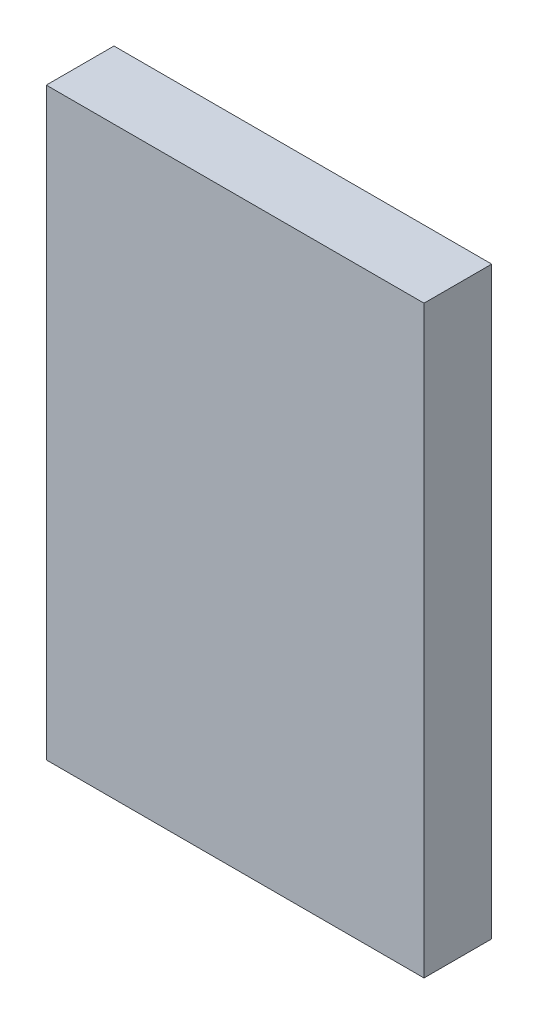
ISO-10303-21;
HEADER;
FILE_DESCRIPTION(('STEP AP214'),'2;1');
FILE_NAME('part.step','',(''),(''),'','','');
FILE_SCHEMA(('AUTOMOTIVE_DESIGN { 1 0 10303 214 1 1 1 1 }'));
ENDSEC;
DATA;
#1=APPLICATION_CONTEXT('core data for automotive mechanical design processes');
#2=APPLICATION_PROTOCOL_DEFINITION('international standard','automotive_design',2000,#1);
#3=PRODUCT_CONTEXT('',#1,'mechanical');
#4=PRODUCT('Part','Part','',(#3));
#5=PRODUCT_RELATED_PRODUCT_CATEGORY('part','',(#4));
#6=PRODUCT_DEFINITION_FORMATION('','',#4);
#7=PRODUCT_DEFINITION_CONTEXT('part definition',#1,'design');
#8=PRODUCT_DEFINITION('design','',#6,#7);
#9=PRODUCT_DEFINITION_SHAPE('','',#8);
#10=(LENGTH_UNIT() NAMED_UNIT(*) SI_UNIT(.MILLI.,.METRE.));
#11=(NAMED_UNIT(*) PLANE_ANGLE_UNIT() SI_UNIT($,.RADIAN.));
#12=(NAMED_UNIT(*) SI_UNIT($,.STERADIAN.) SOLID_ANGLE_UNIT());
#13=UNCERTAINTY_MEASURE_WITH_UNIT(LENGTH_MEASURE(1.E-05),#10,'distance_accuracy_value','');
#14=(GEOMETRIC_REPRESENTATION_CONTEXT(3) GLOBAL_UNCERTAINTY_ASSIGNED_CONTEXT((#13)) GLOBAL_UNIT_ASSIGNED_CONTEXT((#10,
#11,#12)) REPRESENTATION_CONTEXT('',''));
#15=CARTESIAN_POINT('',(0.,0.,0.));
#16=DIRECTION('',(0.,0.,1.));
#17=DIRECTION('',(1.,0.,0.));
#18=AXIS2_PLACEMENT_3D('',#15,#16,#17);
#19=CARTESIAN_POINT('',(0.,0.,9.5));
#20=DIRECTION('',(0.,1.,0.));
#21=DIRECTION('',(0.,0.,1.));
#22=AXIS2_PLACEMENT_3D('',#19,#20,#21);
#23=PLANE('',#22);
#24=DIRECTION('',(1.,0.,0.));
#25=VECTOR('',#24,1.);
#26=CARTESIAN_POINT('',(0.,0.,0.));
#27=LINE('',#26,#25);
#28=CARTESIAN_POINT('',(27.25,0.,0.));
#29=VERTEX_POINT('',#28);
#30=CARTESIAN_POINT('',(44.25,0.,0.));
#31=VERTEX_POINT('',#30);
#32=EDGE_CURVE('E471',#29,#31,#27,.T.);
#33=ORIENTED_EDGE('',*,*,#32,.T.);
#34=DIRECTION('',(0.,0.,-1.));
#35=VECTOR('',#34,1.);
#36=CARTESIAN_POINT('',(44.25,0.,5.5));
#37=LINE('',#36,#35);
#38=CARTESIAN_POINT('',(44.25,0.,5.5));
#39=VERTEX_POINT('',#38);
#40=EDGE_CURVE('E65',#39,#31,#37,.T.);
#41=ORIENTED_EDGE('',*,*,#40,.F.);
#42=DIRECTION('',(1.,0.,0.));
#43=VECTOR('',#42,1.);
#44=CARTESIAN_POINT('',(0.,0.,5.5));
#45=LINE('',#44,#43);
#46=CARTESIAN_POINT('',(45.75,0.,5.5));
#47=VERTEX_POINT('',#46);
#48=EDGE_CURVE('E60',#39,#47,#45,.T.);
#49=ORIENTED_EDGE('',*,*,#48,.T.);
#50=DIRECTION('',(0.,0.,-1.));
#51=VECTOR('',#50,1.);
#52=CARTESIAN_POINT('',(45.75,0.,5.5));
#53=LINE('',#52,#51);
#54=CARTESIAN_POINT('',(45.75,0.,0.));
#55=VERTEX_POINT('',#54);
#56=EDGE_CURVE('E246',#47,#55,#53,.T.);
#57=ORIENTED_EDGE('',*,*,#56,.T.);
#58=CARTESIAN_POINT('',(53.,0.,0.));
#59=VERTEX_POINT('',#58);
#60=EDGE_CURVE('E402',#55,#59,#27,.T.);
#61=ORIENTED_EDGE('',*,*,#60,.T.);
#62=DIRECTION('',(0.,0.,-1.));
#63=VECTOR('',#62,1.);
#64=CARTESIAN_POINT('',(53.,0.,9.5));
#65=LINE('',#64,#63);
#66=CARTESIAN_POINT('',(53.,0.,9.5));
#67=VERTEX_POINT('',#66);
#68=EDGE_CURVE('E11',#67,#59,#65,.T.);
#69=ORIENTED_EDGE('',*,*,#68,.F.);
#70=DIRECTION('',(1.,0.,0.));
#71=VECTOR('',#70,1.);
#72=CARTESIAN_POINT('',(0.,0.,9.5));
#73=LINE('',#72,#71);
#74=CARTESIAN_POINT('',(0.,0.,9.5));
#75=VERTEX_POINT('',#74);
#76=EDGE_CURVE('E403',#75,#67,#73,.T.);
#77=ORIENTED_EDGE('',*,*,#76,.F.);
#78=DIRECTION('',(0.,0.,-1.));
#79=VECTOR('',#78,1.);
#80=CARTESIAN_POINT('',(0.,0.,9.5));
#81=LINE('',#80,#79);
#82=CARTESIAN_POINT('',(0.,0.,0.));
#83=VERTEX_POINT('',#82);
#84=EDGE_CURVE('E419',#75,#83,#81,.T.);
#85=ORIENTED_EDGE('',*,*,#84,.T.);
#86=CARTESIAN_POINT('',(7.25,0.,0.));
#87=VERTEX_POINT('',#86);
#88=EDGE_CURVE('E420',#83,#87,#27,.T.);
#89=ORIENTED_EDGE('',*,*,#88,.T.);
#90=DIRECTION('',(0.,0.,-1.));
#91=VECTOR('',#90,1.);
#92=CARTESIAN_POINT('',(7.25,0.,5.5));
#93=LINE('',#92,#91);
#94=CARTESIAN_POINT('',(7.25,0.,5.5));
#95=VERTEX_POINT('',#94);
#96=EDGE_CURVE('E305',#95,#87,#93,.T.);
#97=ORIENTED_EDGE('',*,*,#96,.F.);
#98=DIRECTION('',(1.,0.,0.));
#99=VECTOR('',#98,1.);
#100=CARTESIAN_POINT('',(0.,0.,5.5));
#101=LINE('',#100,#99);
#102=CARTESIAN_POINT('',(8.75,0.,5.5));
#103=VERTEX_POINT('',#102);
#104=EDGE_CURVE('E301',#95,#103,#101,.T.);
#105=ORIENTED_EDGE('',*,*,#104,.T.);
#106=DIRECTION('',(0.,0.,-1.));
#107=VECTOR('',#106,1.);
#108=CARTESIAN_POINT('',(8.75,0.,5.5));
#109=LINE('',#108,#107);
#110=CARTESIAN_POINT('',(8.75,0.,0.));
#111=VERTEX_POINT('',#110);
#112=EDGE_CURVE('E316',#103,#111,#109,.T.);
#113=ORIENTED_EDGE('',*,*,#112,.T.);
#114=CARTESIAN_POINT('',(25.75,0.,0.));
#115=VERTEX_POINT('',#114);
#116=EDGE_CURVE('E425',#111,#115,#27,.T.);
#117=ORIENTED_EDGE('',*,*,#116,.T.);
#118=DIRECTION('',(0.,0.,-1.));
#119=VECTOR('',#118,1.);
#120=CARTESIAN_POINT('',(25.75,0.,5.5));
#121=LINE('',#120,#119);
#122=CARTESIAN_POINT('',(25.75,0.,5.5));
#123=VERTEX_POINT('',#122);
#124=EDGE_CURVE('E266',#123,#115,#121,.T.);
#125=ORIENTED_EDGE('',*,*,#124,.F.);
#126=DIRECTION('',(1.,0.,0.));
#127=VECTOR('',#126,1.);
#128=CARTESIAN_POINT('',(0.,0.,5.5));
#129=LINE('',#128,#127);
#130=CARTESIAN_POINT('',(27.25,0.,5.5));
#131=VERTEX_POINT('',#130);
#132=EDGE_CURVE('E263',#123,#131,#129,.T.);
#133=ORIENTED_EDGE('',*,*,#132,.T.);
#134=DIRECTION('',(0.,0.,-1.));
#135=VECTOR('',#134,1.);
#136=CARTESIAN_POINT('',(27.25,0.,5.5));
#137=LINE('',#136,#135);
#138=EDGE_CURVE('E279',#131,#29,#137,.T.);
#139=ORIENTED_EDGE('',*,*,#138,.T.);
#140=EDGE_LOOP('',(#33,#41,#49,#57,#61,#69,#77,#85,#89,#97,#105,#113,#117,#125,#133,#139));
#141=FACE_BOUND('',#140,.T.);
#142=ADVANCED_FACE('F45',(#141),#23,.F.);
#143=CARTESIAN_POINT('',(53.,0.,9.5));
#144=DIRECTION('',(-1.,0.,0.));
#145=DIRECTION('',(0.,0.,1.));
#146=AXIS2_PLACEMENT_3D('',#143,#144,#145);
#147=PLANE('',#146);
#148=DIRECTION('',(0.,1.,0.));
#149=VECTOR('',#148,1.);
#150=CARTESIAN_POINT('',(53.,0.,0.));
#151=LINE('',#150,#149);
#152=CARTESIAN_POINT('',(53.,82.,0.));
#153=VERTEX_POINT('',#152);
#154=EDGE_CURVE('E424',#59,#153,#151,.T.);
#155=ORIENTED_EDGE('',*,*,#154,.T.);
#156=DIRECTION('',(0.,0.,-1.));
#157=VECTOR('',#156,1.);
#158=CARTESIAN_POINT('',(53.,82.,9.5));
#159=LINE('',#158,#157);
#160=CARTESIAN_POINT('',(53.,82.,9.5));
#161=VERTEX_POINT('',#160);
#162=EDGE_CURVE('E53',#161,#153,#159,.T.);
#163=ORIENTED_EDGE('',*,*,#162,.F.);
#164=DIRECTION('',(0.,1.,0.));
#165=VECTOR('',#164,1.);
#166=CARTESIAN_POINT('',(53.,0.,9.5));
#167=LINE('',#166,#165);
#168=EDGE_CURVE('E407',#67,#161,#167,.T.);
#169=ORIENTED_EDGE('',*,*,#168,.F.);
#170=ORIENTED_EDGE('',*,*,#68,.T.);
#171=EDGE_LOOP('',(#155,#163,#169,#170));
#172=FACE_BOUND('',#171,.T.);
#173=ADVANCED_FACE('F451',(#172),#147,.F.);
#174=CARTESIAN_POINT('',(0.,82.,9.5));
#175=DIRECTION('',(0.,1.,0.));
#176=DIRECTION('',(0.,0.,1.));
#177=AXIS2_PLACEMENT_3D('',#174,#175,#176);
#178=PLANE('',#177);
#179=DIRECTION('',(1.,0.,0.));
#180=VECTOR('',#179,1.);
#181=CARTESIAN_POINT('',(0.,82.,0.));
#182=LINE('',#181,#180);
#183=CARTESIAN_POINT('',(0.,82.,0.));
#184=VERTEX_POINT('',#183);
#185=EDGE_CURVE('E429',#184,#153,#182,.T.);
#186=ORIENTED_EDGE('',*,*,#185,.F.);
#187=DIRECTION('',(0.,0.,-1.));
#188=VECTOR('',#187,1.);
#189=CARTESIAN_POINT('',(0.,82.,9.5));
#190=LINE('',#189,#188);
#191=CARTESIAN_POINT('',(0.,82.,9.5));
#192=VERTEX_POINT('',#191);
#193=EDGE_CURVE('E440',#192,#184,#190,.T.);
#194=ORIENTED_EDGE('',*,*,#193,.F.);
#195=DIRECTION('',(1.,0.,0.));
#196=VECTOR('',#195,1.);
#197=CARTESIAN_POINT('',(0.,82.,9.5));
#198=LINE('',#197,#196);
#199=EDGE_CURVE('E411',#192,#161,#198,.T.);
#200=ORIENTED_EDGE('',*,*,#199,.T.);
#201=ORIENTED_EDGE('',*,*,#162,.T.);
#202=EDGE_LOOP('',(#186,#194,#200,#201));
#203=FACE_BOUND('',#202,.T.);
#204=ADVANCED_FACE('F447',(#203),#178,.T.);
#205=CARTESIAN_POINT('',(0.,0.,9.5));
#206=DIRECTION('',(-1.,0.,0.));
#207=DIRECTION('',(0.,0.,1.));
#208=AXIS2_PLACEMENT_3D('',#205,#206,#207);
#209=PLANE('',#208);
#210=DIRECTION('',(0.,0.,-1.));
#211=VECTOR('',#210,1.);
#212=CARTESIAN_POINT('',(0.,14.75,5.5));
#213=LINE('',#212,#211);
#214=CARTESIAN_POINT('',(0.,14.75,5.5));
#215=VERTEX_POINT('',#214);
#216=CARTESIAN_POINT('',(0.,14.75,0.));
#217=VERTEX_POINT('',#216);
#218=EDGE_CURVE('E342',#215,#217,#213,.T.);
#219=ORIENTED_EDGE('',*,*,#218,.F.);
#220=DIRECTION('',(0.,1.,0.));
#221=VECTOR('',#220,1.);
#222=CARTESIAN_POINT('',(0.,0.,5.5));
#223=LINE('',#222,#221);
#224=CARTESIAN_POINT('',(0.,13.25,5.5));
#225=VERTEX_POINT('',#224);
#226=EDGE_CURVE('E339',#225,#215,#223,.T.);
#227=ORIENTED_EDGE('',*,*,#226,.F.);
#228=DIRECTION('',(0.,0.,-1.));
#229=VECTOR('',#228,1.);
#230=CARTESIAN_POINT('',(0.,13.25,5.5));
#231=LINE('',#230,#229);
#232=CARTESIAN_POINT('',(0.,13.25,0.));
#233=VERTEX_POINT('',#232);
#234=EDGE_CURVE('E353',#225,#233,#231,.T.);
#235=ORIENTED_EDGE('',*,*,#234,.T.);
#236=DIRECTION('',(0.,1.,0.));
#237=VECTOR('',#236,1.);
#238=CARTESIAN_POINT('',(0.,0.,0.));
#239=LINE('',#238,#237);
#240=EDGE_CURVE('E408',#83,#233,#239,.T.);
#241=ORIENTED_EDGE('',*,*,#240,.F.);
#242=ORIENTED_EDGE('',*,*,#84,.F.);
#243=DIRECTION('',(0.,1.,0.));
#244=VECTOR('',#243,1.);
#245=CARTESIAN_POINT('',(0.,0.,9.5));
#246=LINE('',#245,#244);
#247=EDGE_CURVE('E415',#75,#192,#246,.T.);
#248=ORIENTED_EDGE('',*,*,#247,.T.);
#249=ORIENTED_EDGE('',*,*,#193,.T.);
#250=CARTESIAN_POINT('',(0.,68.75,0.));
#251=VERTEX_POINT('',#250);
#252=EDGE_CURVE('E433',#251,#184,#239,.T.);
#253=ORIENTED_EDGE('',*,*,#252,.F.);
#254=DIRECTION('',(0.,0.,-1.));
#255=VECTOR('',#254,1.);
#256=CARTESIAN_POINT('',(0.,68.75,5.5));
#257=LINE('',#256,#255);
#258=CARTESIAN_POINT('',(0.,68.75,5.5));
#259=VERTEX_POINT('',#258);
#260=EDGE_CURVE('E379',#259,#251,#257,.T.);
#261=ORIENTED_EDGE('',*,*,#260,.F.);
#262=DIRECTION('',(0.,1.,0.));
#263=VECTOR('',#262,1.);
#264=CARTESIAN_POINT('',(0.,0.,5.5));
#265=LINE('',#264,#263);
#266=CARTESIAN_POINT('',(0.,67.25,5.5));
#267=VERTEX_POINT('',#266);
#268=EDGE_CURVE('E376',#267,#259,#265,.T.);
#269=ORIENTED_EDGE('',*,*,#268,.F.);
#270=DIRECTION('',(0.,0.,-1.));
#271=VECTOR('',#270,1.);
#272=CARTESIAN_POINT('',(0.,67.25,5.5));
#273=LINE('',#272,#271);
#274=CARTESIAN_POINT('',(0.,67.25,0.));
#275=VERTEX_POINT('',#274);
#276=EDGE_CURVE('E391',#267,#275,#273,.T.);
#277=ORIENTED_EDGE('',*,*,#276,.T.);
#278=EDGE_CURVE('E437',#217,#275,#239,.T.);
#279=ORIENTED_EDGE('',*,*,#278,.F.);
#280=EDGE_LOOP('',(#219,#227,#235,#241,#242,#248,#249,#253,#261,#269,#277,#279));
#281=FACE_BOUND('',#280,.T.);
#282=ADVANCED_FACE('F463',(#281),#209,.T.);
#283=CARTESIAN_POINT('',(0.,0.,9.5));
#284=DIRECTION('',(0.,0.,1.));
#285=DIRECTION('',(1.,0.,0.));
#286=AXIS2_PLACEMENT_3D('',#283,#284,#285);
#287=PLANE('',#286);
#288=ORIENTED_EDGE('',*,*,#76,.T.);
#289=ORIENTED_EDGE('',*,*,#168,.T.);
#290=ORIENTED_EDGE('',*,*,#199,.F.);
#291=ORIENTED_EDGE('',*,*,#247,.F.);
#292=EDGE_LOOP('',(#288,#289,#290,#291));
#293=FACE_BOUND('',#292,.T.);
#294=ADVANCED_FACE('F466',(#293),#287,.T.);
#295=CARTESIAN_POINT('',(0.,0.,0.));
#296=DIRECTION('',(0.,0.,1.));
#297=DIRECTION('',(1.,0.,0.));
#298=AXIS2_PLACEMENT_3D('',#295,#296,#297);
#299=PLANE('',#298);
#300=ORIENTED_EDGE('',*,*,#88,.F.);
#301=ORIENTED_EDGE('',*,*,#240,.T.);
#302=DIRECTION('',(1.,0.,0.));
#303=VECTOR('',#302,1.);
#304=CARTESIAN_POINT('',(0.,13.25,0.));
#305=LINE('',#304,#303);
#306=CARTESIAN_POINT('',(-0.75,13.25,0.));
#307=VERTEX_POINT('',#306);
#308=EDGE_CURVE('E333',#307,#233,#305,.T.);
#309=ORIENTED_EDGE('',*,*,#308,.F.);
#310=CARTESIAN_POINT('',(-0.75,14.,0.));
#311=DIRECTION('',(0.,0.,1.));
#312=DIRECTION('',(1.,0.,0.));
#313=AXIS2_PLACEMENT_3D('',#310,#311,#312);
#314=CIRCLE('',#313,0.750000000000001);
#315=CARTESIAN_POINT('',(-0.75,14.75,0.));
#316=VERTEX_POINT('',#315);
#317=EDGE_CURVE('E345',#316,#307,#314,.T.);
#318=ORIENTED_EDGE('',*,*,#317,.F.);
#319=DIRECTION('',(1.,0.,0.));
#320=VECTOR('',#319,1.);
#321=CARTESIAN_POINT('',(0.,14.75,0.));
#322=LINE('',#321,#320);
#323=EDGE_CURVE('E327',#316,#217,#322,.T.);
#324=ORIENTED_EDGE('',*,*,#323,.T.);
#325=ORIENTED_EDGE('',*,*,#278,.T.);
#326=DIRECTION('',(1.,0.,0.));
#327=VECTOR('',#326,1.);
#328=CARTESIAN_POINT('',(0.,67.25,0.));
#329=LINE('',#328,#327);
#330=CARTESIAN_POINT('',(-0.75,67.25,0.));
#331=VERTEX_POINT('',#330);
#332=EDGE_CURVE('E370',#331,#275,#329,.T.);
#333=ORIENTED_EDGE('',*,*,#332,.F.);
#334=CARTESIAN_POINT('',(-0.75,68.,0.));
#335=DIRECTION('',(0.,0.,1.));
#336=DIRECTION('',(1.,0.,0.));
#337=AXIS2_PLACEMENT_3D('',#334,#335,#336);
#338=CIRCLE('',#337,0.750000000000001);
#339=CARTESIAN_POINT('',(-0.75,68.75,0.));
#340=VERTEX_POINT('',#339);
#341=EDGE_CURVE('E383',#340,#331,#338,.T.);
#342=ORIENTED_EDGE('',*,*,#341,.F.);
#343=DIRECTION('',(1.,0.,0.));
#344=VECTOR('',#343,1.);
#345=CARTESIAN_POINT('',(0.,68.75,0.));
#346=LINE('',#345,#344);
#347=EDGE_CURVE('E364',#340,#251,#346,.T.);
#348=ORIENTED_EDGE('',*,*,#347,.T.);
#349=ORIENTED_EDGE('',*,*,#252,.T.);
#350=ORIENTED_EDGE('',*,*,#185,.T.);
#351=ORIENTED_EDGE('',*,*,#154,.F.);
#352=ORIENTED_EDGE('',*,*,#60,.F.);
#353=DIRECTION('',(0.,1.,0.));
#354=VECTOR('',#353,1.);
#355=CARTESIAN_POINT('',(45.75,0.,0.));
#356=LINE('',#355,#354);
#357=CARTESIAN_POINT('',(45.75,-0.75,0.));
#358=VERTEX_POINT('',#357);
#359=EDGE_CURVE('E229',#358,#55,#356,.T.);
#360=ORIENTED_EDGE('',*,*,#359,.F.);
#361=CARTESIAN_POINT('',(45.,-0.75,0.));
#362=DIRECTION('',(0.,0.,1.));
#363=DIRECTION('',(1.,0.,0.));
#364=AXIS2_PLACEMENT_3D('',#361,#362,#363);
#365=CIRCLE('',#364,0.750000000000001);
#366=CARTESIAN_POINT('',(44.25,-0.75,0.));
#367=VERTEX_POINT('',#366);
#368=EDGE_CURVE('E233',#367,#358,#365,.T.);
#369=ORIENTED_EDGE('',*,*,#368,.F.);
#370=DIRECTION('',(0.,1.,0.));
#371=VECTOR('',#370,1.);
#372=CARTESIAN_POINT('',(44.25,0.,0.));
#373=LINE('',#372,#371);
#374=EDGE_CURVE('E211',#367,#31,#373,.T.);
#375=ORIENTED_EDGE('',*,*,#374,.T.);
#376=ORIENTED_EDGE('',*,*,#32,.F.);
#377=DIRECTION('',(0.,1.,0.));
#378=VECTOR('',#377,1.);
#379=CARTESIAN_POINT('',(27.25,0.,0.));
#380=LINE('',#379,#378);
#381=CARTESIAN_POINT('',(27.25,-0.75,0.));
#382=VERTEX_POINT('',#381);
#383=EDGE_CURVE('E256',#382,#29,#380,.T.);
#384=ORIENTED_EDGE('',*,*,#383,.F.);
#385=CARTESIAN_POINT('',(26.5,-0.75,0.));
#386=DIRECTION('',(0.,0.,1.));
#387=DIRECTION('',(1.,0.,0.));
#388=AXIS2_PLACEMENT_3D('',#385,#386,#387);
#389=CIRCLE('',#388,0.750000000000001);
#390=CARTESIAN_POINT('',(25.75,-0.75,0.));
#391=VERTEX_POINT('',#390);
#392=EDGE_CURVE('E270',#391,#382,#389,.T.);
#393=ORIENTED_EDGE('',*,*,#392,.F.);
#394=DIRECTION('',(0.,1.,0.));
#395=VECTOR('',#394,1.);
#396=CARTESIAN_POINT('',(25.75,0.,0.));
#397=LINE('',#396,#395);
#398=EDGE_CURVE('E215',#391,#115,#397,.T.);
#399=ORIENTED_EDGE('',*,*,#398,.T.);
#400=ORIENTED_EDGE('',*,*,#116,.F.);
#401=DIRECTION('',(0.,1.,0.));
#402=VECTOR('',#401,1.);
#403=CARTESIAN_POINT('',(8.75,0.,0.));
#404=LINE('',#403,#402);
#405=CARTESIAN_POINT('',(8.75,-0.75,0.));
#406=VERTEX_POINT('',#405);
#407=EDGE_CURVE('E295',#406,#111,#404,.T.);
#408=ORIENTED_EDGE('',*,*,#407,.F.);
#409=CARTESIAN_POINT('',(8.,-0.75,0.));
#410=DIRECTION('',(0.,0.,1.));
#411=DIRECTION('',(1.,0.,0.));
#412=AXIS2_PLACEMENT_3D('',#409,#410,#411);
#413=CIRCLE('',#412,0.750000000000001);
#414=CARTESIAN_POINT('',(7.25,-0.75,0.));
#415=VERTEX_POINT('',#414);
#416=EDGE_CURVE('E309',#415,#406,#413,.T.);
#417=ORIENTED_EDGE('',*,*,#416,.F.);
#418=DIRECTION('',(0.,1.,0.));
#419=VECTOR('',#418,1.);
#420=CARTESIAN_POINT('',(7.25,0.,0.));
#421=LINE('',#420,#419);
#422=EDGE_CURVE('E290',#415,#87,#421,.T.);
#423=ORIENTED_EDGE('',*,*,#422,.T.);
#424=EDGE_LOOP('',(#300,#301,#309,#318,#324,#325,#333,#342,#348,#349,#350,#351,#352,#360,#369,
#375,#376,#384,#393,#399,#400,#408,#417,#423));
#425=FACE_BOUND('',#424,.T.);
#426=ADVANCED_FACE('F455',(#425),#299,.F.);
#427=CARTESIAN_POINT('',(0.,68.75,5.5));
#428=DIRECTION('',(0.,1.,0.));
#429=DIRECTION('',(0.,0.,1.));
#430=AXIS2_PLACEMENT_3D('',#427,#428,#429);
#431=PLANE('',#430);
#432=ORIENTED_EDGE('',*,*,#347,.F.);
#433=DIRECTION('',(0.,0.,-1.));
#434=VECTOR('',#433,1.);
#435=CARTESIAN_POINT('',(-0.75,68.75,5.5));
#436=LINE('',#435,#434);
#437=CARTESIAN_POINT('',(-0.75,68.75,5.5));
#438=VERTEX_POINT('',#437);
#439=EDGE_CURVE('E399',#438,#340,#436,.T.);
#440=ORIENTED_EDGE('',*,*,#439,.F.);
#441=DIRECTION('',(1.,0.,0.));
#442=VECTOR('',#441,1.);
#443=CARTESIAN_POINT('',(0.,68.75,5.5));
#444=LINE('',#443,#442);
#445=EDGE_CURVE('E365',#438,#259,#444,.T.);
#446=ORIENTED_EDGE('',*,*,#445,.T.);
#447=ORIENTED_EDGE('',*,*,#260,.T.);
#448=EDGE_LOOP('',(#432,#440,#446,#447));
#449=FACE_BOUND('',#448,.T.);
#450=ADVANCED_FACE('F515',(#449),#431,.T.);
#451=CARTESIAN_POINT('',(-0.75,68.,5.5));
#452=DIRECTION('',(0.,0.,-1.));
#453=DIRECTION('',(-1.,0.,0.));
#454=AXIS2_PLACEMENT_3D('',#451,#452,#453);
#455=CYLINDRICAL_SURFACE('',#454,0.750000000000001);
#456=ORIENTED_EDGE('',*,*,#341,.T.);
#457=DIRECTION('',(0.,0.,-1.));
#458=VECTOR('',#457,1.);
#459=CARTESIAN_POINT('',(-0.75,67.25,5.5));
#460=LINE('',#459,#458);
#461=CARTESIAN_POINT('',(-0.75,67.25,5.5));
#462=VERTEX_POINT('',#461);
#463=EDGE_CURVE('E395',#462,#331,#460,.T.);
#464=ORIENTED_EDGE('',*,*,#463,.F.);
#465=CARTESIAN_POINT('',(-0.75,68.,5.5));
#466=DIRECTION('',(0.,0.,1.));
#467=DIRECTION('',(1.,0.,0.));
#468=AXIS2_PLACEMENT_3D('',#465,#466,#467);
#469=CIRCLE('',#468,0.750000000000001);
#470=EDGE_CURVE('E369',#438,#462,#469,.T.);
#471=ORIENTED_EDGE('',*,*,#470,.F.);
#472=ORIENTED_EDGE('',*,*,#439,.T.);
#473=EDGE_LOOP('',(#456,#464,#471,#472));
#474=FACE_BOUND('',#473,.T.);
#475=ADVANCED_FACE('F520',(#474),#455,.T.);
#476=CARTESIAN_POINT('',(0.,67.25,5.5));
#477=DIRECTION('',(0.,1.,0.));
#478=DIRECTION('',(0.,0.,1.));
#479=AXIS2_PLACEMENT_3D('',#476,#477,#478);
#480=PLANE('',#479);
#481=ORIENTED_EDGE('',*,*,#332,.T.);
#482=ORIENTED_EDGE('',*,*,#276,.F.);
#483=DIRECTION('',(1.,0.,0.));
#484=VECTOR('',#483,1.);
#485=CARTESIAN_POINT('',(0.,67.25,5.5));
#486=LINE('',#485,#484);
#487=EDGE_CURVE('E373',#462,#267,#486,.T.);
#488=ORIENTED_EDGE('',*,*,#487,.F.);
#489=ORIENTED_EDGE('',*,*,#463,.T.);
#490=EDGE_LOOP('',(#481,#482,#488,#489));
#491=FACE_BOUND('',#490,.T.);
#492=ADVANCED_FACE('F524',(#491),#480,.F.);
#493=CARTESIAN_POINT('',(0.,0.,5.5));
#494=DIRECTION('',(0.,0.,1.));
#495=DIRECTION('',(1.,0.,0.));
#496=AXIS2_PLACEMENT_3D('',#493,#494,#495);
#497=PLANE('',#496);
#498=ORIENTED_EDGE('',*,*,#445,.F.);
#499=ORIENTED_EDGE('',*,*,#470,.T.);
#500=ORIENTED_EDGE('',*,*,#487,.T.);
#501=ORIENTED_EDGE('',*,*,#268,.T.);
#502=EDGE_LOOP('',(#498,#499,#500,#501));
#503=FACE_BOUND('',#502,.T.);
#504=ADVANCED_FACE('F528',(#503),#497,.T.);
#505=CARTESIAN_POINT('',(0.,14.75,5.5));
#506=DIRECTION('',(0.,1.,0.));
#507=DIRECTION('',(0.,0.,1.));
#508=AXIS2_PLACEMENT_3D('',#505,#506,#507);
#509=PLANE('',#508);
#510=ORIENTED_EDGE('',*,*,#323,.F.);
#511=DIRECTION('',(0.,0.,-1.));
#512=VECTOR('',#511,1.);
#513=CARTESIAN_POINT('',(-0.75,14.75,5.5));
#514=LINE('',#513,#512);
#515=CARTESIAN_POINT('',(-0.75,14.75,5.5));
#516=VERTEX_POINT('',#515);
#517=EDGE_CURVE('E361',#516,#316,#514,.T.);
#518=ORIENTED_EDGE('',*,*,#517,.F.);
#519=DIRECTION('',(1.,0.,0.));
#520=VECTOR('',#519,1.);
#521=CARTESIAN_POINT('',(0.,14.75,5.5));
#522=LINE('',#521,#520);
#523=EDGE_CURVE('E328',#516,#215,#522,.T.);
#524=ORIENTED_EDGE('',*,*,#523,.T.);
#525=ORIENTED_EDGE('',*,*,#218,.T.);
#526=EDGE_LOOP('',(#510,#518,#524,#525));
#527=FACE_BOUND('',#526,.T.);
#528=ADVANCED_FACE('F532',(#527),#509,.T.);
#529=CARTESIAN_POINT('',(-0.75,14.,5.5));
#530=DIRECTION('',(0.,0.,-1.));
#531=DIRECTION('',(-1.,0.,0.));
#532=AXIS2_PLACEMENT_3D('',#529,#530,#531);
#533=CYLINDRICAL_SURFACE('',#532,0.750000000000001);
#534=ORIENTED_EDGE('',*,*,#317,.T.);
#535=DIRECTION('',(0.,0.,-1.));
#536=VECTOR('',#535,1.);
#537=CARTESIAN_POINT('',(-0.75,13.25,5.5));
#538=LINE('',#537,#536);
#539=CARTESIAN_POINT('',(-0.75,13.25,5.5));
#540=VERTEX_POINT('',#539);
#541=EDGE_CURVE('E357',#540,#307,#538,.T.);
#542=ORIENTED_EDGE('',*,*,#541,.F.);
#543=CARTESIAN_POINT('',(-0.75,14.,5.5));
#544=DIRECTION('',(0.,0.,1.));
#545=DIRECTION('',(1.,0.,0.));
#546=AXIS2_PLACEMENT_3D('',#543,#544,#545);
#547=CIRCLE('',#546,0.750000000000001);
#548=EDGE_CURVE('E332',#516,#540,#547,.T.);
#549=ORIENTED_EDGE('',*,*,#548,.F.);
#550=ORIENTED_EDGE('',*,*,#517,.T.);
#551=EDGE_LOOP('',(#534,#542,#549,#550));
#552=FACE_BOUND('',#551,.T.);
#553=ADVANCED_FACE('F536',(#552),#533,.T.);
#554=CARTESIAN_POINT('',(0.,13.25,5.5));
#555=DIRECTION('',(0.,1.,0.));
#556=DIRECTION('',(0.,0.,1.));
#557=AXIS2_PLACEMENT_3D('',#554,#555,#556);
#558=PLANE('',#557);
#559=ORIENTED_EDGE('',*,*,#308,.T.);
#560=ORIENTED_EDGE('',*,*,#234,.F.);
#561=DIRECTION('',(1.,0.,0.));
#562=VECTOR('',#561,1.);
#563=CARTESIAN_POINT('',(0.,13.25,5.5));
#564=LINE('',#563,#562);
#565=EDGE_CURVE('E336',#540,#225,#564,.T.);
#566=ORIENTED_EDGE('',*,*,#565,.F.);
#567=ORIENTED_EDGE('',*,*,#541,.T.);
#568=EDGE_LOOP('',(#559,#560,#566,#567));
#569=FACE_BOUND('',#568,.T.);
#570=ADVANCED_FACE('F540',(#569),#558,.F.);
#571=CARTESIAN_POINT('',(0.,0.,5.5));
#572=DIRECTION('',(0.,0.,1.));
#573=DIRECTION('',(1.,0.,0.));
#574=AXIS2_PLACEMENT_3D('',#571,#572,#573);
#575=PLANE('',#574);
#576=ORIENTED_EDGE('',*,*,#523,.F.);
#577=ORIENTED_EDGE('',*,*,#548,.T.);
#578=ORIENTED_EDGE('',*,*,#565,.T.);
#579=ORIENTED_EDGE('',*,*,#226,.T.);
#580=EDGE_LOOP('',(#576,#577,#578,#579));
#581=FACE_BOUND('',#580,.T.);
#582=ADVANCED_FACE('F544',(#581),#575,.T.);
#583=CARTESIAN_POINT('',(7.25,0.,5.5));
#584=DIRECTION('',(-1.,0.,0.));
#585=DIRECTION('',(0.,0.,1.));
#586=AXIS2_PLACEMENT_3D('',#583,#584,#585);
#587=PLANE('',#586);
#588=ORIENTED_EDGE('',*,*,#422,.F.);
#589=DIRECTION('',(0.,0.,-1.));
#590=VECTOR('',#589,1.);
#591=CARTESIAN_POINT('',(7.25,-0.75,5.5));
#592=LINE('',#591,#590);
#593=CARTESIAN_POINT('',(7.25,-0.75,5.5));
#594=VERTEX_POINT('',#593);
#595=EDGE_CURVE('E324',#594,#415,#592,.T.);
#596=ORIENTED_EDGE('',*,*,#595,.F.);
#597=DIRECTION('',(0.,1.,0.));
#598=VECTOR('',#597,1.);
#599=CARTESIAN_POINT('',(7.25,0.,5.5));
#600=LINE('',#599,#598);
#601=EDGE_CURVE('E291',#594,#95,#600,.T.);
#602=ORIENTED_EDGE('',*,*,#601,.T.);
#603=ORIENTED_EDGE('',*,*,#96,.T.);
#604=EDGE_LOOP('',(#588,#596,#602,#603));
#605=FACE_BOUND('',#604,.T.);
#606=ADVANCED_FACE('F548',(#605),#587,.T.);
#607=CARTESIAN_POINT('',(8.,-0.75,5.5));
#608=DIRECTION('',(0.,0.,-1.));
#609=DIRECTION('',(-1.,0.,0.));
#610=AXIS2_PLACEMENT_3D('',#607,#608,#609);
#611=CYLINDRICAL_SURFACE('',#610,0.750000000000001);
#612=ORIENTED_EDGE('',*,*,#416,.T.);
#613=DIRECTION('',(0.,0.,-1.));
#614=VECTOR('',#613,1.);
#615=CARTESIAN_POINT('',(8.75,-0.75,5.5));
#616=LINE('',#615,#614);
#617=CARTESIAN_POINT('',(8.75,-0.75,5.5));
#618=VERTEX_POINT('',#617);
#619=EDGE_CURVE('E320',#618,#406,#616,.T.);
#620=ORIENTED_EDGE('',*,*,#619,.F.);
#621=CARTESIAN_POINT('',(8.,-0.75,5.5));
#622=DIRECTION('',(0.,0.,1.));
#623=DIRECTION('',(1.,0.,0.));
#624=AXIS2_PLACEMENT_3D('',#621,#622,#623);
#625=CIRCLE('',#624,0.750000000000001);
#626=EDGE_CURVE('E294',#594,#618,#625,.T.);
#627=ORIENTED_EDGE('',*,*,#626,.F.);
#628=ORIENTED_EDGE('',*,*,#595,.T.);
#629=EDGE_LOOP('',(#612,#620,#627,#628));
#630=FACE_BOUND('',#629,.T.);
#631=ADVANCED_FACE('F552',(#630),#611,.T.);
#632=CARTESIAN_POINT('',(8.75,0.,5.5));
#633=DIRECTION('',(-1.,0.,0.));
#634=DIRECTION('',(0.,0.,1.));
#635=AXIS2_PLACEMENT_3D('',#632,#633,#634);
#636=PLANE('',#635);
#637=ORIENTED_EDGE('',*,*,#407,.T.);
#638=ORIENTED_EDGE('',*,*,#112,.F.);
#639=DIRECTION('',(0.,1.,0.));
#640=VECTOR('',#639,1.);
#641=CARTESIAN_POINT('',(8.75,0.,5.5));
#642=LINE('',#641,#640);
#643=EDGE_CURVE('E298',#618,#103,#642,.T.);
#644=ORIENTED_EDGE('',*,*,#643,.F.);
#645=ORIENTED_EDGE('',*,*,#619,.T.);
#646=EDGE_LOOP('',(#637,#638,#644,#645));
#647=FACE_BOUND('',#646,.T.);
#648=ADVANCED_FACE('F556',(#647),#636,.F.);
#649=CARTESIAN_POINT('',(0.,0.,5.5));
#650=DIRECTION('',(0.,0.,1.));
#651=DIRECTION('',(1.,0.,0.));
#652=AXIS2_PLACEMENT_3D('',#649,#650,#651);
#653=PLANE('',#652);
#654=ORIENTED_EDGE('',*,*,#601,.F.);
#655=ORIENTED_EDGE('',*,*,#626,.T.);
#656=ORIENTED_EDGE('',*,*,#643,.T.);
#657=ORIENTED_EDGE('',*,*,#104,.F.);
#658=EDGE_LOOP('',(#654,#655,#656,#657));
#659=FACE_BOUND('',#658,.T.);
#660=ADVANCED_FACE('F560',(#659),#653,.T.);
#661=CARTESIAN_POINT('',(25.75,0.,5.5));
#662=DIRECTION('',(-1.,0.,0.));
#663=DIRECTION('',(0.,0.,1.));
#664=AXIS2_PLACEMENT_3D('',#661,#662,#663);
#665=PLANE('',#664);
#666=ORIENTED_EDGE('',*,*,#398,.F.);
#667=DIRECTION('',(0.,0.,-1.));
#668=VECTOR('',#667,1.);
#669=CARTESIAN_POINT('',(25.75,-0.75,5.5));
#670=LINE('',#669,#668);
#671=CARTESIAN_POINT('',(25.75,-0.75,5.5));
#672=VERTEX_POINT('',#671);
#673=EDGE_CURVE('E287',#672,#391,#670,.T.);
#674=ORIENTED_EDGE('',*,*,#673,.F.);
#675=DIRECTION('',(0.,1.,0.));
#676=VECTOR('',#675,1.);
#677=CARTESIAN_POINT('',(25.75,0.,5.5));
#678=LINE('',#677,#676);
#679=EDGE_CURVE('E251',#672,#123,#678,.T.);
#680=ORIENTED_EDGE('',*,*,#679,.T.);
#681=ORIENTED_EDGE('',*,*,#124,.T.);
#682=EDGE_LOOP('',(#666,#674,#680,#681));
#683=FACE_BOUND('',#682,.T.);
#684=ADVANCED_FACE('F479',(#683),#665,.T.);
#685=CARTESIAN_POINT('',(26.5,-0.75,5.5));
#686=DIRECTION('',(0.,0.,-1.));
#687=DIRECTION('',(-1.,0.,0.));
#688=AXIS2_PLACEMENT_3D('',#685,#686,#687);
#689=CYLINDRICAL_SURFACE('',#688,0.750000000000001);
#690=ORIENTED_EDGE('',*,*,#392,.T.);
#691=DIRECTION('',(0.,0.,-1.));
#692=VECTOR('',#691,1.);
#693=CARTESIAN_POINT('',(27.25,-0.75,5.5));
#694=LINE('',#693,#692);
#695=CARTESIAN_POINT('',(27.25,-0.75,5.5));
#696=VERTEX_POINT('',#695);
#697=EDGE_CURVE('E283',#696,#382,#694,.T.);
#698=ORIENTED_EDGE('',*,*,#697,.F.);
#699=CARTESIAN_POINT('',(26.5,-0.75,5.5));
#700=DIRECTION('',(0.,0.,1.));
#701=DIRECTION('',(1.,0.,0.));
#702=AXIS2_PLACEMENT_3D('',#699,#700,#701);
#703=CIRCLE('',#702,0.750000000000001);
#704=EDGE_CURVE('E255',#672,#696,#703,.T.);
#705=ORIENTED_EDGE('',*,*,#704,.F.);
#706=ORIENTED_EDGE('',*,*,#673,.T.);
#707=EDGE_LOOP('',(#690,#698,#705,#706));
#708=FACE_BOUND('',#707,.T.);
#709=ADVANCED_FACE('F486',(#708),#689,.T.);
#710=CARTESIAN_POINT('',(27.25,0.,5.5));
#711=DIRECTION('',(-1.,0.,0.));
#712=DIRECTION('',(0.,0.,1.));
#713=AXIS2_PLACEMENT_3D('',#710,#711,#712);
#714=PLANE('',#713);
#715=ORIENTED_EDGE('',*,*,#383,.T.);
#716=ORIENTED_EDGE('',*,*,#138,.F.);
#717=DIRECTION('',(0.,1.,0.));
#718=VECTOR('',#717,1.);
#719=CARTESIAN_POINT('',(27.25,0.,5.5));
#720=LINE('',#719,#718);
#721=EDGE_CURVE('E259',#696,#131,#720,.T.);
#722=ORIENTED_EDGE('',*,*,#721,.F.);
#723=ORIENTED_EDGE('',*,*,#697,.T.);
#724=EDGE_LOOP('',(#715,#716,#722,#723));
#725=FACE_BOUND('',#724,.T.);
#726=ADVANCED_FACE('F490',(#725),#714,.F.);
#727=CARTESIAN_POINT('',(0.,0.,5.5));
#728=DIRECTION('',(0.,0.,1.));
#729=DIRECTION('',(1.,0.,0.));
#730=AXIS2_PLACEMENT_3D('',#727,#728,#729);
#731=PLANE('',#730);
#732=ORIENTED_EDGE('',*,*,#679,.F.);
#733=ORIENTED_EDGE('',*,*,#704,.T.);
#734=ORIENTED_EDGE('',*,*,#721,.T.);
#735=ORIENTED_EDGE('',*,*,#132,.F.);
#736=EDGE_LOOP('',(#732,#733,#734,#735));
#737=FACE_BOUND('',#736,.T.);
#738=ADVANCED_FACE('F493',(#737),#731,.T.);
#739=CARTESIAN_POINT('',(44.25,0.,5.5));
#740=DIRECTION('',(-1.,0.,0.));
#741=DIRECTION('',(0.,0.,1.));
#742=AXIS2_PLACEMENT_3D('',#739,#740,#741);
#743=PLANE('',#742);
#744=ORIENTED_EDGE('',*,*,#374,.F.);
#745=DIRECTION('',(0.,0.,-1.));
#746=VECTOR('',#745,1.);
#747=CARTESIAN_POINT('',(44.25,-0.75,5.5));
#748=LINE('',#747,#746);
#749=CARTESIAN_POINT('',(44.25,-0.75,5.5));
#750=VERTEX_POINT('',#749);
#751=EDGE_CURVE('E205',#750,#367,#748,.T.);
#752=ORIENTED_EDGE('',*,*,#751,.F.);
#753=DIRECTION('',(0.,1.,0.));
#754=VECTOR('',#753,1.);
#755=CARTESIAN_POINT('',(44.25,0.,5.5));
#756=LINE('',#755,#754);
#757=EDGE_CURVE('E209',#750,#39,#756,.T.);
#758=ORIENTED_EDGE('',*,*,#757,.T.);
#759=ORIENTED_EDGE('',*,*,#40,.T.);
#760=EDGE_LOOP('',(#744,#752,#758,#759));
#761=FACE_BOUND('',#760,.T.);
#762=ADVANCED_FACE('F207',(#761),#743,.T.);
#763=CARTESIAN_POINT('',(45.,-0.75,5.5));
#764=DIRECTION('',(0.,0.,-1.));
#765=DIRECTION('',(-1.,0.,0.));
#766=AXIS2_PLACEMENT_3D('',#763,#764,#765);
#767=CYLINDRICAL_SURFACE('',#766,0.750000000000001);
#768=ORIENTED_EDGE('',*,*,#368,.T.);
#769=DIRECTION('',(0.,0.,-1.));
#770=VECTOR('',#769,1.);
#771=CARTESIAN_POINT('',(45.75,-0.75,5.5));
#772=LINE('',#771,#770);
#773=CARTESIAN_POINT('',(45.75,-0.75,5.5));
#774=VERTEX_POINT('',#773);
#775=EDGE_CURVE('E216',#774,#358,#772,.T.);
#776=ORIENTED_EDGE('',*,*,#775,.F.);
#777=CARTESIAN_POINT('',(45.,-0.75,5.5));
#778=DIRECTION('',(0.,0.,1.));
#779=DIRECTION('',(1.,0.,0.));
#780=AXIS2_PLACEMENT_3D('',#777,#778,#779);
#781=CIRCLE('',#780,0.750000000000001);
#782=EDGE_CURVE('E219',#750,#774,#781,.T.);
#783=ORIENTED_EDGE('',*,*,#782,.F.);
#784=ORIENTED_EDGE('',*,*,#751,.T.);
#785=EDGE_LOOP('',(#768,#776,#783,#784));
#786=FACE_BOUND('',#785,.T.);
#787=ADVANCED_FACE('F220',(#786),#767,.T.);
#788=CARTESIAN_POINT('',(45.75,0.,5.5));
#789=DIRECTION('',(-1.,0.,0.));
#790=DIRECTION('',(0.,0.,1.));
#791=AXIS2_PLACEMENT_3D('',#788,#789,#790);
#792=PLANE('',#791);
#793=ORIENTED_EDGE('',*,*,#359,.T.);
#794=ORIENTED_EDGE('',*,*,#56,.F.);
#795=DIRECTION('',(0.,1.,0.));
#796=VECTOR('',#795,1.);
#797=CARTESIAN_POINT('',(45.75,0.,5.5));
#798=LINE('',#797,#796);
#799=EDGE_CURVE('E225',#774,#47,#798,.T.);
#800=ORIENTED_EDGE('',*,*,#799,.F.);
#801=ORIENTED_EDGE('',*,*,#775,.T.);
#802=EDGE_LOOP('',(#793,#794,#800,#801));
#803=FACE_BOUND('',#802,.T.);
#804=ADVANCED_FACE('F595',(#803),#792,.F.);
#805=CARTESIAN_POINT('',(0.,0.,5.5));
#806=DIRECTION('',(0.,0.,1.));
#807=DIRECTION('',(1.,0.,0.));
#808=AXIS2_PLACEMENT_3D('',#805,#806,#807);
#809=PLANE('',#808);
#810=ORIENTED_EDGE('',*,*,#757,.F.);
#811=ORIENTED_EDGE('',*,*,#782,.T.);
#812=ORIENTED_EDGE('',*,*,#799,.T.);
#813=ORIENTED_EDGE('',*,*,#48,.F.);
#814=EDGE_LOOP('',(#810,#811,#812,#813));
#815=FACE_BOUND('',#814,.T.);
#816=ADVANCED_FACE('F227',(#815),#809,.T.);
#817=CLOSED_SHELL('',(#142,#173,#204,#282,#294,#426,#450,#475,#492,#504,#528,#553,#570,#582,
#606,#631,#648,#660,#684,#709,#726,#738,#762,#787,#804,#816));
#818=MANIFOLD_SOLID_BREP('B2',#817);
#819=ADVANCED_BREP_SHAPE_REPRESENTATION('',(#18,#818),#14);
#820=SHAPE_DEFINITION_REPRESENTATION(#9,#819);
ENDSEC;
END-ISO-10303-21;
